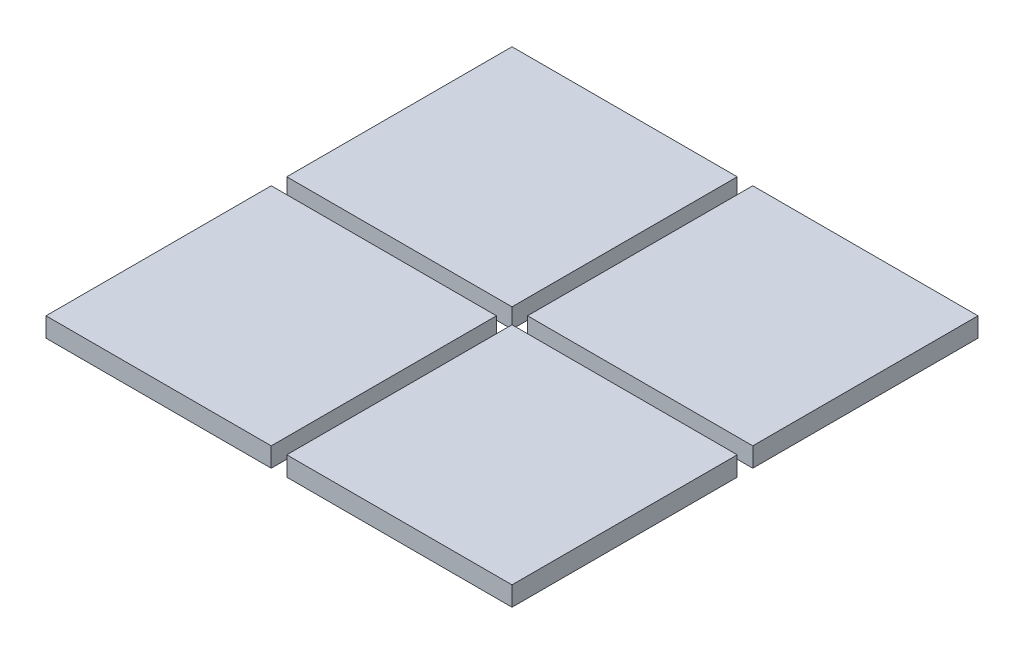
ISO-10303-21;
HEADER;
FILE_DESCRIPTION(('STEP AP214'),'2;1');
FILE_NAME('part.step','',(''),(''),'','','');
FILE_SCHEMA(('AUTOMOTIVE_DESIGN { 1 0 10303 214 1 1 1 1 }'));
ENDSEC;
DATA;
#1=APPLICATION_CONTEXT('core data for automotive mechanical design processes');
#2=APPLICATION_PROTOCOL_DEFINITION('international standard','automotive_design',2000,#1);
#3=PRODUCT_CONTEXT('',#1,'mechanical');
#4=PRODUCT('Part','Part','',(#3));
#5=PRODUCT_RELATED_PRODUCT_CATEGORY('part','',(#4));
#6=PRODUCT_DEFINITION_FORMATION('','',#4);
#7=PRODUCT_DEFINITION_CONTEXT('part definition',#1,'design');
#8=PRODUCT_DEFINITION('design','',#6,#7);
#9=PRODUCT_DEFINITION_SHAPE('','',#8);
#10=(LENGTH_UNIT() NAMED_UNIT(*) SI_UNIT(.MILLI.,.METRE.));
#11=(NAMED_UNIT(*) PLANE_ANGLE_UNIT() SI_UNIT($,.RADIAN.));
#12=(NAMED_UNIT(*) SI_UNIT($,.STERADIAN.) SOLID_ANGLE_UNIT());
#13=UNCERTAINTY_MEASURE_WITH_UNIT(LENGTH_MEASURE(1.E-05),#10,'distance_accuracy_value','');
#14=(GEOMETRIC_REPRESENTATION_CONTEXT(3) GLOBAL_UNCERTAINTY_ASSIGNED_CONTEXT((#13)) GLOBAL_UNIT_ASSIGNED_CONTEXT((#10,
#11,#12)) REPRESENTATION_CONTEXT('',''));
#15=CARTESIAN_POINT('',(0.,0.,0.));
#16=DIRECTION('',(0.,0.,1.));
#17=DIRECTION('',(1.,0.,0.));
#18=AXIS2_PLACEMENT_3D('',#15,#16,#17);
#19=CARTESIAN_POINT('',(0.199999999999998,0.500000000000001,-0.2));
#20=DIRECTION('',(0.,0.,-1.));
#21=DIRECTION('',(0.,-1.,0.));
#22=AXIS2_PLACEMENT_3D('',#19,#20,#21);
#23=PLANE('',#22);
#24=DIRECTION('',(1.,0.,0.));
#25=VECTOR('',#24,1.);
#26=CARTESIAN_POINT('',(0.2,0.,-0.2));
#27=LINE('',#26,#25);
#28=CARTESIAN_POINT('',(0.2,0.,-0.2));
#29=VERTEX_POINT('',#28);
#30=CARTESIAN_POINT('',(6.,0.,-0.2));
#31=VERTEX_POINT('',#30);
#32=EDGE_CURVE('E113',#29,#31,#27,.T.);
#33=ORIENTED_EDGE('',*,*,#32,.T.);
#34=DIRECTION('',(0.,-1.,0.));
#35=VECTOR('',#34,1.);
#36=CARTESIAN_POINT('',(6.,0.500000000000021,-0.2));
#37=LINE('',#36,#35);
#38=CARTESIAN_POINT('',(6.,0.500000000000021,-0.2));
#39=VERTEX_POINT('',#38);
#40=EDGE_CURVE('E12',#39,#31,#37,.T.);
#41=ORIENTED_EDGE('',*,*,#40,.F.);
#42=DIRECTION('',(1.,0.,0.));
#43=VECTOR('',#42,1.);
#44=CARTESIAN_POINT('',(0.199999999999998,0.500000000000001,-0.2));
#45=LINE('',#44,#43);
#46=CARTESIAN_POINT('',(0.199999999999998,0.500000000000001,-0.2));
#47=VERTEX_POINT('',#46);
#48=EDGE_CURVE('E101',#47,#39,#45,.T.);
#49=ORIENTED_EDGE('',*,*,#48,.F.);
#50=DIRECTION('',(0.,-1.,0.));
#51=VECTOR('',#50,1.);
#52=CARTESIAN_POINT('',(0.199999999999998,0.500000000000001,-0.2));
#53=LINE('',#52,#51);
#54=EDGE_CURVE('E109',#47,#29,#53,.T.);
#55=ORIENTED_EDGE('',*,*,#54,.T.);
#56=EDGE_LOOP('',(#33,#41,#49,#55));
#57=FACE_BOUND('',#56,.T.);
#58=ADVANCED_FACE('F50',(#57),#23,.F.);
#59=CARTESIAN_POINT('',(6.,0.500000000000021,-0.2));
#60=DIRECTION('',(-1.,0.,0.));
#61=DIRECTION('',(0.,0.,1.));
#62=AXIS2_PLACEMENT_3D('',#59,#60,#61);
#63=PLANE('',#62);
#64=DIRECTION('',(0.,0.,-1.));
#65=VECTOR('',#64,1.);
#66=CARTESIAN_POINT('',(6.,0.,-0.2));
#67=LINE('',#66,#65);
#68=CARTESIAN_POINT('',(6.,0.,-6.));
#69=VERTEX_POINT('',#68);
#70=EDGE_CURVE('E105',#31,#69,#67,.T.);
#71=ORIENTED_EDGE('',*,*,#70,.T.);
#72=DIRECTION('',(0.,-1.,0.));
#73=VECTOR('',#72,1.);
#74=CARTESIAN_POINT('',(6.,0.500000000000021,-6.));
#75=LINE('',#74,#73);
#76=CARTESIAN_POINT('',(6.,0.500000000000021,-6.));
#77=VERTEX_POINT('',#76);
#78=EDGE_CURVE('E58',#77,#69,#75,.T.);
#79=ORIENTED_EDGE('',*,*,#78,.F.);
#80=DIRECTION('',(0.,0.,-1.));
#81=VECTOR('',#80,1.);
#82=CARTESIAN_POINT('',(6.,0.500000000000021,-0.2));
#83=LINE('',#82,#81);
#84=EDGE_CURVE('E96',#39,#77,#83,.T.);
#85=ORIENTED_EDGE('',*,*,#84,.F.);
#86=ORIENTED_EDGE('',*,*,#40,.T.);
#87=EDGE_LOOP('',(#71,#79,#85,#86));
#88=FACE_BOUND('',#87,.T.);
#89=ADVANCED_FACE('F104',(#88),#63,.F.);
#90=CARTESIAN_POINT('',(0.199999999999998,0.500000000000001,-6.));
#91=DIRECTION('',(0.,0.,1.));
#92=DIRECTION('',(0.,1.,0.));
#93=AXIS2_PLACEMENT_3D('',#90,#91,#92);
#94=PLANE('',#93);
#95=DIRECTION('',(-1.,0.,0.));
#96=VECTOR('',#95,1.);
#97=CARTESIAN_POINT('',(0.2,0.,-6.));
#98=LINE('',#97,#96);
#99=CARTESIAN_POINT('',(0.2,0.,-6.));
#100=VERTEX_POINT('',#99);
#101=EDGE_CURVE('E83',#69,#100,#98,.T.);
#102=ORIENTED_EDGE('',*,*,#101,.T.);
#103=DIRECTION('',(0.,-1.,0.));
#104=VECTOR('',#103,1.);
#105=CARTESIAN_POINT('',(0.199999999999998,0.500000000000001,-6.));
#106=LINE('',#105,#104);
#107=CARTESIAN_POINT('',(0.199999999999998,0.500000000000001,-6.));
#108=VERTEX_POINT('',#107);
#109=EDGE_CURVE('E106',#108,#100,#106,.T.);
#110=ORIENTED_EDGE('',*,*,#109,.F.);
#111=DIRECTION('',(-1.,0.,0.));
#112=VECTOR('',#111,1.);
#113=CARTESIAN_POINT('',(0.199999999999998,0.500000000000001,-6.));
#114=LINE('',#113,#112);
#115=EDGE_CURVE('E99',#77,#108,#114,.T.);
#116=ORIENTED_EDGE('',*,*,#115,.F.);
#117=ORIENTED_EDGE('',*,*,#78,.T.);
#118=EDGE_LOOP('',(#102,#110,#116,#117));
#119=FACE_BOUND('',#118,.T.);
#120=ADVANCED_FACE('F107',(#119),#94,.F.);
#121=CARTESIAN_POINT('',(0.199999999999998,0.500000000000001,-0.2));
#122=DIRECTION('',(1.,0.,0.));
#123=DIRECTION('',(0.,0.,-1.));
#124=AXIS2_PLACEMENT_3D('',#121,#122,#123);
#125=PLANE('',#124);
#126=DIRECTION('',(0.,0.,1.));
#127=VECTOR('',#126,1.);
#128=CARTESIAN_POINT('',(0.2,0.,-0.2));
#129=LINE('',#128,#127);
#130=EDGE_CURVE('E89',#100,#29,#129,.T.);
#131=ORIENTED_EDGE('',*,*,#130,.T.);
#132=ORIENTED_EDGE('',*,*,#54,.F.);
#133=DIRECTION('',(0.,0.,1.));
#134=VECTOR('',#133,1.);
#135=CARTESIAN_POINT('',(0.199999999999998,0.500000000000001,-0.2));
#136=LINE('',#135,#134);
#137=EDGE_CURVE('E66',#108,#47,#136,.T.);
#138=ORIENTED_EDGE('',*,*,#137,.F.);
#139=ORIENTED_EDGE('',*,*,#109,.T.);
#140=EDGE_LOOP('',(#131,#132,#138,#139));
#141=FACE_BOUND('',#140,.T.);
#142=ADVANCED_FACE('F120',(#141),#125,.F.);
#143=CARTESIAN_POINT('',(0.,0.5,0.));
#144=DIRECTION('',(0.,1.,0.));
#145=DIRECTION('',(0.,0.,-1.));
#146=AXIS2_PLACEMENT_3D('',#143,#144,#145);
#147=PLANE('',#146);
#148=ORIENTED_EDGE('',*,*,#48,.T.);
#149=ORIENTED_EDGE('',*,*,#84,.T.);
#150=ORIENTED_EDGE('',*,*,#115,.T.);
#151=ORIENTED_EDGE('',*,*,#137,.T.);
#152=EDGE_LOOP('',(#148,#149,#150,#151));
#153=FACE_BOUND('',#152,.T.);
#154=ADVANCED_FACE('F97',(#153),#147,.T.);
#155=CARTESIAN_POINT('',(0.,0.,0.));
#156=DIRECTION('',(0.,1.,0.));
#157=DIRECTION('',(0.,0.,-1.));
#158=AXIS2_PLACEMENT_3D('',#155,#156,#157);
#159=PLANE('',#158);
#160=ORIENTED_EDGE('',*,*,#32,.F.);
#161=ORIENTED_EDGE('',*,*,#130,.F.);
#162=ORIENTED_EDGE('',*,*,#101,.F.);
#163=ORIENTED_EDGE('',*,*,#70,.F.);
#164=EDGE_LOOP('',(#160,#161,#162,#163));
#165=FACE_BOUND('',#164,.T.);
#166=ADVANCED_FACE('F123',(#165),#159,.F.);
#167=CLOSED_SHELL('',(#58,#89,#120,#142,#154,#166));
#168=MANIFOLD_SOLID_BREP('B2',#167);
#169=CARTESIAN_POINT('',(-0.200000000000002,0.499999999999999,-0.2));
#170=DIRECTION('',(0.,0.,-1.));
#171=DIRECTION('',(0.,-1.,0.));
#172=AXIS2_PLACEMENT_3D('',#169,#170,#171);
#173=PLANE('',#172);
#174=DIRECTION('',(1.,0.,0.));
#175=VECTOR('',#174,1.);
#176=CARTESIAN_POINT('',(-0.2,0.,-0.2));
#177=LINE('',#176,#175);
#178=CARTESIAN_POINT('',(-6.,0.,-0.2));
#179=VERTEX_POINT('',#178);
#180=CARTESIAN_POINT('',(-0.2,0.,-0.2));
#181=VERTEX_POINT('',#180);
#182=EDGE_CURVE('E247',#179,#181,#177,.T.);
#183=ORIENTED_EDGE('',*,*,#182,.T.);
#184=DIRECTION('',(0.,-1.,0.));
#185=VECTOR('',#184,1.);
#186=CARTESIAN_POINT('',(-0.200000000000002,0.499999999999999,-0.2));
#187=LINE('',#186,#185);
#188=CARTESIAN_POINT('',(-0.200000000000002,0.499999999999999,-0.2));
#189=VERTEX_POINT('',#188);
#190=EDGE_CURVE('E48',#189,#181,#187,.T.);
#191=ORIENTED_EDGE('',*,*,#190,.F.);
#192=DIRECTION('',(1.,0.,0.));
#193=VECTOR('',#192,1.);
#194=CARTESIAN_POINT('',(-0.200000000000002,0.499999999999999,-0.2));
#195=LINE('',#194,#193);
#196=CARTESIAN_POINT('',(-6.,0.499999999999979,-0.2));
#197=VERTEX_POINT('',#196);
#198=EDGE_CURVE('E235',#197,#189,#195,.T.);
#199=ORIENTED_EDGE('',*,*,#198,.F.);
#200=DIRECTION('',(0.,-1.,0.));
#201=VECTOR('',#200,1.);
#202=CARTESIAN_POINT('',(-6.,0.499999999999979,-0.2));
#203=LINE('',#202,#201);
#204=EDGE_CURVE('E243',#197,#179,#203,.T.);
#205=ORIENTED_EDGE('',*,*,#204,.T.);
#206=EDGE_LOOP('',(#183,#191,#199,#205));
#207=FACE_BOUND('',#206,.T.);
#208=ADVANCED_FACE('F184',(#207),#173,.F.);
#209=CARTESIAN_POINT('',(-0.200000000000002,0.499999999999999,-0.2));
#210=DIRECTION('',(-1.,0.,0.));
#211=DIRECTION('',(0.,0.,1.));
#212=AXIS2_PLACEMENT_3D('',#209,#210,#211);
#213=PLANE('',#212);
#214=DIRECTION('',(0.,0.,-1.));
#215=VECTOR('',#214,1.);
#216=CARTESIAN_POINT('',(-0.2,0.,-0.2));
#217=LINE('',#216,#215);
#218=CARTESIAN_POINT('',(-0.2,0.,-6.));
#219=VERTEX_POINT('',#218);
#220=EDGE_CURVE('E239',#181,#219,#217,.T.);
#221=ORIENTED_EDGE('',*,*,#220,.T.);
#222=DIRECTION('',(0.,-1.,0.));
#223=VECTOR('',#222,1.);
#224=CARTESIAN_POINT('',(-0.200000000000002,0.499999999999999,-6.));
#225=LINE('',#224,#223);
#226=CARTESIAN_POINT('',(-0.200000000000002,0.499999999999999,-6.));
#227=VERTEX_POINT('',#226);
#228=EDGE_CURVE('E192',#227,#219,#225,.T.);
#229=ORIENTED_EDGE('',*,*,#228,.F.);
#230=DIRECTION('',(0.,0.,-1.));
#231=VECTOR('',#230,1.);
#232=CARTESIAN_POINT('',(-0.200000000000002,0.499999999999999,-0.2));
#233=LINE('',#232,#231);
#234=EDGE_CURVE('E230',#189,#227,#233,.T.);
#235=ORIENTED_EDGE('',*,*,#234,.F.);
#236=ORIENTED_EDGE('',*,*,#190,.T.);
#237=EDGE_LOOP('',(#221,#229,#235,#236));
#238=FACE_BOUND('',#237,.T.);
#239=ADVANCED_FACE('F238',(#238),#213,.F.);
#240=CARTESIAN_POINT('',(-0.200000000000002,0.499999999999999,-6.));
#241=DIRECTION('',(0.,0.,1.));
#242=DIRECTION('',(0.,1.,0.));
#243=AXIS2_PLACEMENT_3D('',#240,#241,#242);
#244=PLANE('',#243);
#245=DIRECTION('',(-1.,0.,0.));
#246=VECTOR('',#245,1.);
#247=CARTESIAN_POINT('',(-0.2,0.,-6.));
#248=LINE('',#247,#246);
#249=CARTESIAN_POINT('',(-6.,0.,-6.));
#250=VERTEX_POINT('',#249);
#251=EDGE_CURVE('E217',#219,#250,#248,.T.);
#252=ORIENTED_EDGE('',*,*,#251,.T.);
#253=DIRECTION('',(0.,-1.,0.));
#254=VECTOR('',#253,1.);
#255=CARTESIAN_POINT('',(-6.,0.499999999999979,-6.));
#256=LINE('',#255,#254);
#257=CARTESIAN_POINT('',(-6.,0.499999999999979,-6.));
#258=VERTEX_POINT('',#257);
#259=EDGE_CURVE('E240',#258,#250,#256,.T.);
#260=ORIENTED_EDGE('',*,*,#259,.F.);
#261=DIRECTION('',(-1.,0.,0.));
#262=VECTOR('',#261,1.);
#263=CARTESIAN_POINT('',(-0.200000000000002,0.499999999999999,-6.));
#264=LINE('',#263,#262);
#265=EDGE_CURVE('E233',#227,#258,#264,.T.);
#266=ORIENTED_EDGE('',*,*,#265,.F.);
#267=ORIENTED_EDGE('',*,*,#228,.T.);
#268=EDGE_LOOP('',(#252,#260,#266,#267));
#269=FACE_BOUND('',#268,.T.);
#270=ADVANCED_FACE('F241',(#269),#244,.F.);
#271=CARTESIAN_POINT('',(-6.,0.499999999999979,-0.2));
#272=DIRECTION('',(1.,0.,0.));
#273=DIRECTION('',(0.,0.,-1.));
#274=AXIS2_PLACEMENT_3D('',#271,#272,#273);
#275=PLANE('',#274);
#276=DIRECTION('',(0.,0.,1.));
#277=VECTOR('',#276,1.);
#278=CARTESIAN_POINT('',(-6.,0.,-0.2));
#279=LINE('',#278,#277);
#280=EDGE_CURVE('E223',#250,#179,#279,.T.);
#281=ORIENTED_EDGE('',*,*,#280,.T.);
#282=ORIENTED_EDGE('',*,*,#204,.F.);
#283=DIRECTION('',(0.,0.,1.));
#284=VECTOR('',#283,1.);
#285=CARTESIAN_POINT('',(-6.,0.499999999999979,-0.2));
#286=LINE('',#285,#284);
#287=EDGE_CURVE('E200',#258,#197,#286,.T.);
#288=ORIENTED_EDGE('',*,*,#287,.F.);
#289=ORIENTED_EDGE('',*,*,#259,.T.);
#290=EDGE_LOOP('',(#281,#282,#288,#289));
#291=FACE_BOUND('',#290,.T.);
#292=ADVANCED_FACE('F254',(#291),#275,.F.);
#293=CARTESIAN_POINT('',(0.,0.5,0.));
#294=DIRECTION('',(0.,-1.,0.));
#295=DIRECTION('',(0.,0.,1.));
#296=AXIS2_PLACEMENT_3D('',#293,#294,#295);
#297=PLANE('',#296);
#298=ORIENTED_EDGE('',*,*,#198,.T.);
#299=ORIENTED_EDGE('',*,*,#234,.T.);
#300=ORIENTED_EDGE('',*,*,#265,.T.);
#301=ORIENTED_EDGE('',*,*,#287,.T.);
#302=EDGE_LOOP('',(#298,#299,#300,#301));
#303=FACE_BOUND('',#302,.T.);
#304=ADVANCED_FACE('F231',(#303),#297,.F.);
#305=CARTESIAN_POINT('',(0.,0.,0.));
#306=DIRECTION('',(0.,-1.,0.));
#307=DIRECTION('',(0.,0.,1.));
#308=AXIS2_PLACEMENT_3D('',#305,#306,#307);
#309=PLANE('',#308);
#310=ORIENTED_EDGE('',*,*,#182,.F.);
#311=ORIENTED_EDGE('',*,*,#280,.F.);
#312=ORIENTED_EDGE('',*,*,#251,.F.);
#313=ORIENTED_EDGE('',*,*,#220,.F.);
#314=EDGE_LOOP('',(#310,#311,#312,#313));
#315=FACE_BOUND('',#314,.T.);
#316=ADVANCED_FACE('F257',(#315),#309,.T.);
#317=CLOSED_SHELL('',(#208,#239,#270,#292,#304,#316));
#318=MANIFOLD_SOLID_BREP('B6',#317);
#319=CARTESIAN_POINT('',(-0.200000000000002,0.499999999999999,0.2));
#320=DIRECTION('',(0.,0.,1.));
#321=DIRECTION('',(0.,1.,0.));
#322=AXIS2_PLACEMENT_3D('',#319,#320,#321);
#323=PLANE('',#322);
#324=DIRECTION('',(-1.,0.,0.));
#325=VECTOR('',#324,1.);
#326=CARTESIAN_POINT('',(-0.2,0.,0.2));
#327=LINE('',#326,#325);
#328=CARTESIAN_POINT('',(-0.2,0.,0.2));
#329=VERTEX_POINT('',#328);
#330=CARTESIAN_POINT('',(-6.,0.,0.2));
#331=VERTEX_POINT('',#330);
#332=EDGE_CURVE('E395',#329,#331,#327,.T.);
#333=ORIENTED_EDGE('',*,*,#332,.T.);
#334=DIRECTION('',(0.,-1.,0.));
#335=VECTOR('',#334,1.);
#336=CARTESIAN_POINT('',(-6.,0.499999999999979,0.2));
#337=LINE('',#336,#335);
#338=CARTESIAN_POINT('',(-6.,0.499999999999979,0.2));
#339=VERTEX_POINT('',#338);
#340=EDGE_CURVE('E182',#339,#331,#337,.T.);
#341=ORIENTED_EDGE('',*,*,#340,.F.);
#342=DIRECTION('',(-1.,0.,0.));
#343=VECTOR('',#342,1.);
#344=CARTESIAN_POINT('',(-0.200000000000002,0.499999999999999,0.2));
#345=LINE('',#344,#343);
#346=CARTESIAN_POINT('',(-0.200000000000002,0.499999999999999,0.2));
#347=VERTEX_POINT('',#346);
#348=EDGE_CURVE('E383',#347,#339,#345,.T.);
#349=ORIENTED_EDGE('',*,*,#348,.F.);
#350=DIRECTION('',(0.,-1.,0.));
#351=VECTOR('',#350,1.);
#352=CARTESIAN_POINT('',(-0.200000000000002,0.499999999999999,0.2));
#353=LINE('',#352,#351);
#354=EDGE_CURVE('E391',#347,#329,#353,.T.);
#355=ORIENTED_EDGE('',*,*,#354,.T.);
#356=EDGE_LOOP('',(#333,#341,#349,#355));
#357=FACE_BOUND('',#356,.T.);
#358=ADVANCED_FACE('F332',(#357),#323,.F.);
#359=CARTESIAN_POINT('',(-6.,0.499999999999979,0.2));
#360=DIRECTION('',(1.,0.,0.));
#361=DIRECTION('',(0.,0.,-1.));
#362=AXIS2_PLACEMENT_3D('',#359,#360,#361);
#363=PLANE('',#362);
#364=DIRECTION('',(0.,0.,1.));
#365=VECTOR('',#364,1.);
#366=CARTESIAN_POINT('',(-6.,0.,0.2));
#367=LINE('',#366,#365);
#368=CARTESIAN_POINT('',(-6.,0.,6.));
#369=VERTEX_POINT('',#368);
#370=EDGE_CURVE('E387',#331,#369,#367,.T.);
#371=ORIENTED_EDGE('',*,*,#370,.T.);
#372=DIRECTION('',(0.,-1.,0.));
#373=VECTOR('',#372,1.);
#374=CARTESIAN_POINT('',(-6.,0.499999999999979,6.));
#375=LINE('',#374,#373);
#376=CARTESIAN_POINT('',(-6.,0.499999999999979,6.));
#377=VERTEX_POINT('',#376);
#378=EDGE_CURVE('E340',#377,#369,#375,.T.);
#379=ORIENTED_EDGE('',*,*,#378,.F.);
#380=DIRECTION('',(0.,0.,1.));
#381=VECTOR('',#380,1.);
#382=CARTESIAN_POINT('',(-6.,0.499999999999979,0.2));
#383=LINE('',#382,#381);
#384=EDGE_CURVE('E378',#339,#377,#383,.T.);
#385=ORIENTED_EDGE('',*,*,#384,.F.);
#386=ORIENTED_EDGE('',*,*,#340,.T.);
#387=EDGE_LOOP('',(#371,#379,#385,#386));
#388=FACE_BOUND('',#387,.T.);
#389=ADVANCED_FACE('F386',(#388),#363,.F.);
#390=CARTESIAN_POINT('',(-0.200000000000002,0.499999999999999,6.));
#391=DIRECTION('',(0.,0.,-1.));
#392=DIRECTION('',(0.,-1.,0.));
#393=AXIS2_PLACEMENT_3D('',#390,#391,#392);
#394=PLANE('',#393);
#395=DIRECTION('',(1.,0.,0.));
#396=VECTOR('',#395,1.);
#397=CARTESIAN_POINT('',(-0.2,0.,6.));
#398=LINE('',#397,#396);
#399=CARTESIAN_POINT('',(-0.2,0.,6.));
#400=VERTEX_POINT('',#399);
#401=EDGE_CURVE('E365',#369,#400,#398,.T.);
#402=ORIENTED_EDGE('',*,*,#401,.T.);
#403=DIRECTION('',(0.,-1.,0.));
#404=VECTOR('',#403,1.);
#405=CARTESIAN_POINT('',(-0.200000000000002,0.499999999999999,6.));
#406=LINE('',#405,#404);
#407=CARTESIAN_POINT('',(-0.200000000000002,0.499999999999999,6.));
#408=VERTEX_POINT('',#407);
#409=EDGE_CURVE('E388',#408,#400,#406,.T.);
#410=ORIENTED_EDGE('',*,*,#409,.F.);
#411=DIRECTION('',(1.,0.,0.));
#412=VECTOR('',#411,1.);
#413=CARTESIAN_POINT('',(-0.200000000000002,0.499999999999999,6.));
#414=LINE('',#413,#412);
#415=EDGE_CURVE('E381',#377,#408,#414,.T.);
#416=ORIENTED_EDGE('',*,*,#415,.F.);
#417=ORIENTED_EDGE('',*,*,#378,.T.);
#418=EDGE_LOOP('',(#402,#410,#416,#417));
#419=FACE_BOUND('',#418,.T.);
#420=ADVANCED_FACE('F389',(#419),#394,.F.);
#421=CARTESIAN_POINT('',(-0.200000000000002,0.499999999999999,0.2));
#422=DIRECTION('',(-1.,0.,0.));
#423=DIRECTION('',(0.,0.,1.));
#424=AXIS2_PLACEMENT_3D('',#421,#422,#423);
#425=PLANE('',#424);
#426=DIRECTION('',(0.,0.,-1.));
#427=VECTOR('',#426,1.);
#428=CARTESIAN_POINT('',(-0.2,0.,0.2));
#429=LINE('',#428,#427);
#430=EDGE_CURVE('E371',#400,#329,#429,.T.);
#431=ORIENTED_EDGE('',*,*,#430,.T.);
#432=ORIENTED_EDGE('',*,*,#354,.F.);
#433=DIRECTION('',(0.,0.,-1.));
#434=VECTOR('',#433,1.);
#435=CARTESIAN_POINT('',(-0.200000000000002,0.499999999999999,0.2));
#436=LINE('',#435,#434);
#437=EDGE_CURVE('E348',#408,#347,#436,.T.);
#438=ORIENTED_EDGE('',*,*,#437,.F.);
#439=ORIENTED_EDGE('',*,*,#409,.T.);
#440=EDGE_LOOP('',(#431,#432,#438,#439));
#441=FACE_BOUND('',#440,.T.);
#442=ADVANCED_FACE('F402',(#441),#425,.F.);
#443=CARTESIAN_POINT('',(0.,0.5,0.));
#444=DIRECTION('',(0.,1.,0.));
#445=DIRECTION('',(0.,0.,-1.));
#446=AXIS2_PLACEMENT_3D('',#443,#444,#445);
#447=PLANE('',#446);
#448=ORIENTED_EDGE('',*,*,#348,.T.);
#449=ORIENTED_EDGE('',*,*,#384,.T.);
#450=ORIENTED_EDGE('',*,*,#415,.T.);
#451=ORIENTED_EDGE('',*,*,#437,.T.);
#452=EDGE_LOOP('',(#448,#449,#450,#451));
#453=FACE_BOUND('',#452,.T.);
#454=ADVANCED_FACE('F379',(#453),#447,.T.);
#455=CARTESIAN_POINT('',(0.,0.,0.));
#456=DIRECTION('',(0.,1.,0.));
#457=DIRECTION('',(0.,0.,-1.));
#458=AXIS2_PLACEMENT_3D('',#455,#456,#457);
#459=PLANE('',#458);
#460=ORIENTED_EDGE('',*,*,#332,.F.);
#461=ORIENTED_EDGE('',*,*,#430,.F.);
#462=ORIENTED_EDGE('',*,*,#401,.F.);
#463=ORIENTED_EDGE('',*,*,#370,.F.);
#464=EDGE_LOOP('',(#460,#461,#462,#463));
#465=FACE_BOUND('',#464,.T.);
#466=ADVANCED_FACE('F405',(#465),#459,.F.);
#467=CLOSED_SHELL('',(#358,#389,#420,#442,#454,#466));
#468=MANIFOLD_SOLID_BREP('B42',#467);
#469=CARTESIAN_POINT('',(0.199999999999998,0.500000000000001,0.2));
#470=DIRECTION('',(0.,0.,1.));
#471=DIRECTION('',(0.,1.,0.));
#472=AXIS2_PLACEMENT_3D('',#469,#470,#471);
#473=PLANE('',#472);
#474=DIRECTION('',(-1.,0.,0.));
#475=VECTOR('',#474,1.);
#476=CARTESIAN_POINT('',(0.2,0.,0.2));
#477=LINE('',#476,#475);
#478=CARTESIAN_POINT('',(6.,0.,0.2));
#479=VERTEX_POINT('',#478);
#480=CARTESIAN_POINT('',(0.2,0.,0.2));
#481=VERTEX_POINT('',#480);
#482=EDGE_CURVE('E519',#479,#481,#477,.T.);
#483=ORIENTED_EDGE('',*,*,#482,.T.);
#484=DIRECTION('',(0.,-1.,0.));
#485=VECTOR('',#484,1.);
#486=CARTESIAN_POINT('',(0.199999999999998,0.500000000000001,0.2));
#487=LINE('',#486,#485);
#488=CARTESIAN_POINT('',(0.199999999999998,0.500000000000001,0.2));
#489=VERTEX_POINT('',#488);
#490=EDGE_CURVE('E330',#489,#481,#487,.T.);
#491=ORIENTED_EDGE('',*,*,#490,.F.);
#492=DIRECTION('',(-1.,0.,0.));
#493=VECTOR('',#492,1.);
#494=CARTESIAN_POINT('',(0.199999999999998,0.500000000000001,0.2));
#495=LINE('',#494,#493);
#496=CARTESIAN_POINT('',(6.,0.500000000000021,0.2));
#497=VERTEX_POINT('',#496);
#498=EDGE_CURVE('E507',#497,#489,#495,.T.);
#499=ORIENTED_EDGE('',*,*,#498,.F.);
#500=DIRECTION('',(0.,-1.,0.));
#501=VECTOR('',#500,1.);
#502=CARTESIAN_POINT('',(6.,0.500000000000021,0.2));
#503=LINE('',#502,#501);
#504=EDGE_CURVE('E515',#497,#479,#503,.T.);
#505=ORIENTED_EDGE('',*,*,#504,.T.);
#506=EDGE_LOOP('',(#483,#491,#499,#505));
#507=FACE_BOUND('',#506,.T.);
#508=ADVANCED_FACE('F456',(#507),#473,.F.);
#509=CARTESIAN_POINT('',(0.199999999999998,0.500000000000001,0.2));
#510=DIRECTION('',(1.,0.,0.));
#511=DIRECTION('',(0.,0.,-1.));
#512=AXIS2_PLACEMENT_3D('',#509,#510,#511);
#513=PLANE('',#512);
#514=DIRECTION('',(0.,0.,1.));
#515=VECTOR('',#514,1.);
#516=CARTESIAN_POINT('',(0.2,0.,0.2));
#517=LINE('',#516,#515);
#518=CARTESIAN_POINT('',(0.2,0.,6.));
#519=VERTEX_POINT('',#518);
#520=EDGE_CURVE('E511',#481,#519,#517,.T.);
#521=ORIENTED_EDGE('',*,*,#520,.T.);
#522=DIRECTION('',(0.,-1.,0.));
#523=VECTOR('',#522,1.);
#524=CARTESIAN_POINT('',(0.199999999999998,0.500000000000001,6.));
#525=LINE('',#524,#523);
#526=CARTESIAN_POINT('',(0.199999999999998,0.500000000000001,6.));
#527=VERTEX_POINT('',#526);
#528=EDGE_CURVE('E464',#527,#519,#525,.T.);
#529=ORIENTED_EDGE('',*,*,#528,.F.);
#530=DIRECTION('',(0.,0.,1.));
#531=VECTOR('',#530,1.);
#532=CARTESIAN_POINT('',(0.199999999999998,0.500000000000001,0.2));
#533=LINE('',#532,#531);
#534=EDGE_CURVE('E502',#489,#527,#533,.T.);
#535=ORIENTED_EDGE('',*,*,#534,.F.);
#536=ORIENTED_EDGE('',*,*,#490,.T.);
#537=EDGE_LOOP('',(#521,#529,#535,#536));
#538=FACE_BOUND('',#537,.T.);
#539=ADVANCED_FACE('F510',(#538),#513,.F.);
#540=CARTESIAN_POINT('',(0.199999999999998,0.500000000000001,6.));
#541=DIRECTION('',(0.,0.,-1.));
#542=DIRECTION('',(0.,-1.,0.));
#543=AXIS2_PLACEMENT_3D('',#540,#541,#542);
#544=PLANE('',#543);
#545=DIRECTION('',(1.,0.,0.));
#546=VECTOR('',#545,1.);
#547=CARTESIAN_POINT('',(0.2,0.,6.));
#548=LINE('',#547,#546);
#549=CARTESIAN_POINT('',(6.,0.,6.));
#550=VERTEX_POINT('',#549);
#551=EDGE_CURVE('E489',#519,#550,#548,.T.);
#552=ORIENTED_EDGE('',*,*,#551,.T.);
#553=DIRECTION('',(0.,-1.,0.));
#554=VECTOR('',#553,1.);
#555=CARTESIAN_POINT('',(6.,0.500000000000021,6.));
#556=LINE('',#555,#554);
#557=CARTESIAN_POINT('',(6.,0.500000000000021,6.));
#558=VERTEX_POINT('',#557);
#559=EDGE_CURVE('E512',#558,#550,#556,.T.);
#560=ORIENTED_EDGE('',*,*,#559,.F.);
#561=DIRECTION('',(1.,0.,0.));
#562=VECTOR('',#561,1.);
#563=CARTESIAN_POINT('',(0.199999999999998,0.500000000000001,6.));
#564=LINE('',#563,#562);
#565=EDGE_CURVE('E505',#527,#558,#564,.T.);
#566=ORIENTED_EDGE('',*,*,#565,.F.);
#567=ORIENTED_EDGE('',*,*,#528,.T.);
#568=EDGE_LOOP('',(#552,#560,#566,#567));
#569=FACE_BOUND('',#568,.T.);
#570=ADVANCED_FACE('F513',(#569),#544,.F.);
#571=CARTESIAN_POINT('',(6.,0.500000000000021,0.2));
#572=DIRECTION('',(-1.,0.,0.));
#573=DIRECTION('',(0.,0.,1.));
#574=AXIS2_PLACEMENT_3D('',#571,#572,#573);
#575=PLANE('',#574);
#576=DIRECTION('',(0.,0.,-1.));
#577=VECTOR('',#576,1.);
#578=CARTESIAN_POINT('',(6.,0.,0.2));
#579=LINE('',#578,#577);
#580=EDGE_CURVE('E495',#550,#479,#579,.T.);
#581=ORIENTED_EDGE('',*,*,#580,.T.);
#582=ORIENTED_EDGE('',*,*,#504,.F.);
#583=DIRECTION('',(0.,0.,-1.));
#584=VECTOR('',#583,1.);
#585=CARTESIAN_POINT('',(6.,0.500000000000021,0.2));
#586=LINE('',#585,#584);
#587=EDGE_CURVE('E472',#558,#497,#586,.T.);
#588=ORIENTED_EDGE('',*,*,#587,.F.);
#589=ORIENTED_EDGE('',*,*,#559,.T.);
#590=EDGE_LOOP('',(#581,#582,#588,#589));
#591=FACE_BOUND('',#590,.T.);
#592=ADVANCED_FACE('F526',(#591),#575,.F.);
#593=CARTESIAN_POINT('',(0.,0.5,0.));
#594=DIRECTION('',(0.,-1.,0.));
#595=DIRECTION('',(0.,0.,1.));
#596=AXIS2_PLACEMENT_3D('',#593,#594,#595);
#597=PLANE('',#596);
#598=ORIENTED_EDGE('',*,*,#498,.T.);
#599=ORIENTED_EDGE('',*,*,#534,.T.);
#600=ORIENTED_EDGE('',*,*,#565,.T.);
#601=ORIENTED_EDGE('',*,*,#587,.T.);
#602=EDGE_LOOP('',(#598,#599,#600,#601));
#603=FACE_BOUND('',#602,.T.);
#604=ADVANCED_FACE('F503',(#603),#597,.F.);
#605=CARTESIAN_POINT('',(0.,0.,0.));
#606=DIRECTION('',(0.,-1.,0.));
#607=DIRECTION('',(0.,0.,1.));
#608=AXIS2_PLACEMENT_3D('',#605,#606,#607);
#609=PLANE('',#608);
#610=ORIENTED_EDGE('',*,*,#482,.F.);
#611=ORIENTED_EDGE('',*,*,#580,.F.);
#612=ORIENTED_EDGE('',*,*,#551,.F.);
#613=ORIENTED_EDGE('',*,*,#520,.F.);
#614=EDGE_LOOP('',(#610,#611,#612,#613));
#615=FACE_BOUND('',#614,.T.);
#616=ADVANCED_FACE('F529',(#615),#609,.T.);
#617=CLOSED_SHELL('',(#508,#539,#570,#592,#604,#616));
#618=MANIFOLD_SOLID_BREP('B176',#617);
#619=ADVANCED_BREP_SHAPE_REPRESENTATION('',(#18,#168,#318,#468,#618),#14);
#620=SHAPE_DEFINITION_REPRESENTATION(#9,#619);
ENDSEC;
END-ISO-10303-21;
